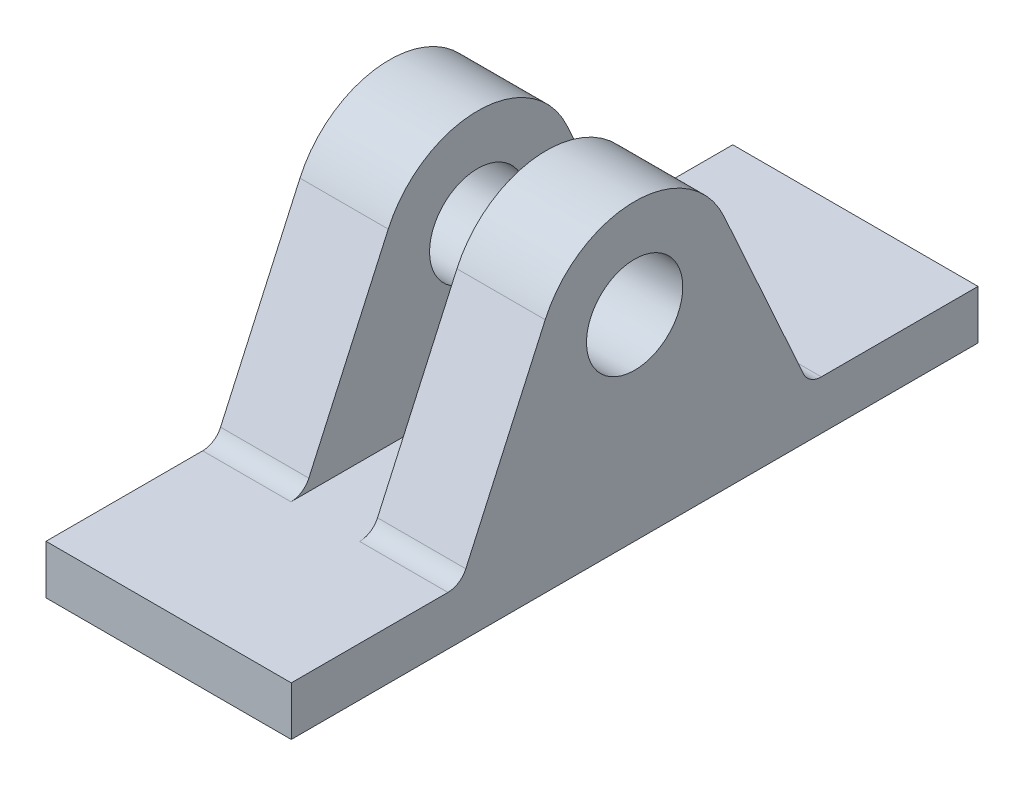
ISO-10303-21;
HEADER;
FILE_DESCRIPTION(('STEP AP214'),'2;1');
FILE_NAME('part.step','',(''),(''),'','','');
FILE_SCHEMA(('AUTOMOTIVE_DESIGN { 1 0 10303 214 1 1 1 1 }'));
ENDSEC;
DATA;
#1=APPLICATION_CONTEXT('core data for automotive mechanical design processes');
#2=APPLICATION_PROTOCOL_DEFINITION('international standard','automotive_design',2000,#1);
#3=PRODUCT_CONTEXT('',#1,'mechanical');
#4=PRODUCT('Part','Part','',(#3));
#5=PRODUCT_RELATED_PRODUCT_CATEGORY('part','',(#4));
#6=PRODUCT_DEFINITION_FORMATION('','',#4);
#7=PRODUCT_DEFINITION_CONTEXT('part definition',#1,'design');
#8=PRODUCT_DEFINITION('design','',#6,#7);
#9=PRODUCT_DEFINITION_SHAPE('','',#8);
#10=(LENGTH_UNIT() NAMED_UNIT(*) SI_UNIT(.MILLI.,.METRE.));
#11=(NAMED_UNIT(*) PLANE_ANGLE_UNIT() SI_UNIT($,.RADIAN.));
#12=(NAMED_UNIT(*) SI_UNIT($,.STERADIAN.) SOLID_ANGLE_UNIT());
#13=UNCERTAINTY_MEASURE_WITH_UNIT(LENGTH_MEASURE(1.E-05),#10,'distance_accuracy_value','');
#14=(GEOMETRIC_REPRESENTATION_CONTEXT(3) GLOBAL_UNCERTAINTY_ASSIGNED_CONTEXT((#13)) GLOBAL_UNIT_ASSIGNED_CONTEXT((#10,
#11,#12)) REPRESENTATION_CONTEXT('',''));
#15=CARTESIAN_POINT('',(0.,0.,0.));
#16=DIRECTION('',(0.,0.,1.));
#17=DIRECTION('',(1.,0.,0.));
#18=AXIS2_PLACEMENT_3D('',#15,#16,#17);
#19=CARTESIAN_POINT('',(-31.75,8.89,-20.2797633552758));
#20=DIRECTION('',(1.,0.,0.));
#21=DIRECTION('',(0.,0.,-1.));
#22=AXIS2_PLACEMENT_3D('',#19,#20,#21);
#23=CYLINDRICAL_SURFACE('',#22,2.54);
#24=CARTESIAN_POINT('',(-20.32,8.89,-20.2797633552758));
#25=DIRECTION('',(-1.,0.,0.));
#26=DIRECTION('',(0.,0.,1.));
#27=AXIS2_PLACEMENT_3D('',#24,#25,#26);
#28=CIRCLE('',#27,2.54);
#29=CARTESIAN_POINT('',(-20.32,7.84524162641579,-22.5949480003583));
#30=VERTEX_POINT('',#29);
#31=CARTESIAN_POINT('',(-20.32,6.35,-20.2797633552758));
#32=VERTEX_POINT('',#31);
#33=EDGE_CURVE('E131',#30,#32,#28,.T.);
#34=ORIENTED_EDGE('',*,*,#33,.F.);
#35=DIRECTION('',(1.,0.,0.));
#36=VECTOR('',#35,1.);
#37=CARTESIAN_POINT('',(-31.75,7.84524162641579,-22.5949480003583));
#38=LINE('',#37,#36);
#39=CARTESIAN_POINT('',(-31.75,7.84524162641579,-22.5949480003583));
#40=VERTEX_POINT('',#39);
#41=EDGE_CURVE('E125',#40,#30,#38,.T.);
#42=ORIENTED_EDGE('',*,*,#41,.F.);
#43=CARTESIAN_POINT('',(-31.75,8.89,-20.2797633552758));
#44=DIRECTION('',(-1.,0.,0.));
#45=DIRECTION('',(0.,0.,-1.));
#46=AXIS2_PLACEMENT_3D('',#43,#44,#45);
#47=CIRCLE('',#46,2.54);
#48=CARTESIAN_POINT('',(-31.75,6.35,-20.2797633552758));
#49=VERTEX_POINT('',#48);
#50=EDGE_CURVE('E128',#40,#49,#47,.T.);
#51=ORIENTED_EDGE('',*,*,#50,.T.);
#52=DIRECTION('',(1.,0.,0.));
#53=VECTOR('',#52,1.);
#54=CARTESIAN_POINT('',(-31.75,6.35,-20.2797633552758));
#55=LINE('',#54,#53);
#56=EDGE_CURVE('E41',#49,#32,#55,.T.);
#57=ORIENTED_EDGE('',*,*,#56,.T.);
#58=EDGE_LOOP('',(#34,#42,#51,#57));
#59=FACE_BOUND('',#58,.T.);
#60=ADVANCED_FACE('F32',(#59),#23,.F.);
#61=CARTESIAN_POINT('',(-31.75,7.84524162641579,-22.5949480003583));
#62=DIRECTION('',(0.,0.411322194324492,0.911490017749007));
#63=DIRECTION('',(0.,-0.911490017749007,0.411322194324492));
#64=AXIS2_PLACEMENT_3D('',#61,#62,#63);
#65=PLANE('',#64);
#66=DIRECTION('',(0.,-0.911490017749007,0.411322194324492));
#67=VECTOR('',#66,1.);
#68=CARTESIAN_POINT('',(-20.32,7.84524162641579,-22.5949480003583));
#69=LINE('',#68,#67);
#70=CARTESIAN_POINT('',(-20.32,30.623791867921,-32.8740767745876));
#71=VERTEX_POINT('',#70);
#72=EDGE_CURVE('E242',#71,#30,#69,.T.);
#73=ORIENTED_EDGE('',*,*,#72,.F.);
#74=DIRECTION('',(1.,0.,0.));
#75=VECTOR('',#74,1.);
#76=CARTESIAN_POINT('',(-31.75,30.623791867921,-32.8740767745876));
#77=LINE('',#76,#75);
#78=CARTESIAN_POINT('',(-31.75,30.623791867921,-32.8740767745876));
#79=VERTEX_POINT('',#78);
#80=EDGE_CURVE('E148',#79,#71,#77,.T.);
#81=ORIENTED_EDGE('',*,*,#80,.F.);
#82=DIRECTION('',(0.,-0.911490017749007,0.411322194324492));
#83=VECTOR('',#82,1.);
#84=CARTESIAN_POINT('',(-31.75,7.84524162641579,-22.5949480003583));
#85=LINE('',#84,#83);
#86=EDGE_CURVE('E142',#79,#40,#85,.T.);
#87=ORIENTED_EDGE('',*,*,#86,.T.);
#88=ORIENTED_EDGE('',*,*,#41,.T.);
#89=EDGE_LOOP('',(#73,#81,#87,#88));
#90=FACE_BOUND('',#89,.T.);
#91=ADVANCED_FACE('F146',(#90),#65,.T.);
#92=CARTESIAN_POINT('',(-31.75,25.4,-44.45));
#93=DIRECTION('',(1.,0.,0.));
#94=DIRECTION('',(0.,0.,-1.));
#95=AXIS2_PLACEMENT_3D('',#92,#93,#94);
#96=CYLINDRICAL_SURFACE('',#95,12.7);
#97=CARTESIAN_POINT('',(-20.32,25.4,-44.45));
#98=DIRECTION('',(-1.,0.,0.));
#99=DIRECTION('',(0.,0.,1.));
#100=AXIS2_PLACEMENT_3D('',#97,#98,#99);
#101=CIRCLE('',#100,12.7);
#102=CARTESIAN_POINT('',(-20.32,30.623791867921,-56.0259232254124));
#103=VERTEX_POINT('',#102);
#104=EDGE_CURVE('E239',#103,#71,#101,.F.);
#105=ORIENTED_EDGE('',*,*,#104,.F.);
#106=DIRECTION('',(1.,0.,0.));
#107=VECTOR('',#106,1.);
#108=CARTESIAN_POINT('',(-31.75,30.623791867921,-56.0259232254124));
#109=LINE('',#108,#107);
#110=CARTESIAN_POINT('',(-31.75,30.623791867921,-56.0259232254124));
#111=VERTEX_POINT('',#110);
#112=EDGE_CURVE('E191',#111,#103,#109,.T.);
#113=ORIENTED_EDGE('',*,*,#112,.F.);
#114=CARTESIAN_POINT('',(-31.75,25.4,-44.45));
#115=DIRECTION('',(1.,0.,0.));
#116=DIRECTION('',(0.,0.,-1.));
#117=AXIS2_PLACEMENT_3D('',#114,#115,#116);
#118=CIRCLE('',#117,12.7);
#119=EDGE_CURVE('E149',#111,#79,#118,.T.);
#120=ORIENTED_EDGE('',*,*,#119,.T.);
#121=ORIENTED_EDGE('',*,*,#80,.T.);
#122=EDGE_LOOP('',(#105,#113,#120,#121));
#123=FACE_BOUND('',#122,.T.);
#124=ADVANCED_FACE('F292',(#123),#96,.T.);
#125=CARTESIAN_POINT('',(-31.75,30.623791867921,-56.0259232254124));
#126=DIRECTION('',(0.,0.411322194324492,-0.911490017749007));
#127=DIRECTION('',(0.,0.911490017749007,0.411322194324492));
#128=AXIS2_PLACEMENT_3D('',#125,#126,#127);
#129=PLANE('',#128);
#130=DIRECTION('',(0.,0.911490017749007,0.411322194324492));
#131=VECTOR('',#130,1.);
#132=CARTESIAN_POINT('',(-20.32,30.623791867921,-56.0259232254124));
#133=LINE('',#132,#131);
#134=CARTESIAN_POINT('',(-20.32,7.84524162641579,-66.3050519996417));
#135=VERTEX_POINT('',#134);
#136=EDGE_CURVE('E236',#135,#103,#133,.T.);
#137=ORIENTED_EDGE('',*,*,#136,.F.);
#138=DIRECTION('',(1.,0.,0.));
#139=VECTOR('',#138,1.);
#140=CARTESIAN_POINT('',(-31.75,7.84524162641579,-66.3050519996417));
#141=LINE('',#140,#139);
#142=CARTESIAN_POINT('',(-31.75,7.84524162641579,-66.3050519996417));
#143=VERTEX_POINT('',#142);
#144=EDGE_CURVE('E195',#143,#135,#141,.T.);
#145=ORIENTED_EDGE('',*,*,#144,.F.);
#146=DIRECTION('',(0.,0.911490017749007,0.411322194324492));
#147=VECTOR('',#146,1.);
#148=CARTESIAN_POINT('',(-31.75,30.623791867921,-56.0259232254124));
#149=LINE('',#148,#147);
#150=EDGE_CURVE('E151',#143,#111,#149,.T.);
#151=ORIENTED_EDGE('',*,*,#150,.T.);
#152=ORIENTED_EDGE('',*,*,#112,.T.);
#153=EDGE_LOOP('',(#137,#145,#151,#152));
#154=FACE_BOUND('',#153,.T.);
#155=ADVANCED_FACE('F266',(#154),#129,.T.);
#156=CARTESIAN_POINT('',(-31.75,8.89,-68.6202366447242));
#157=DIRECTION('',(1.,0.,0.));
#158=DIRECTION('',(0.,0.,-1.));
#159=AXIS2_PLACEMENT_3D('',#156,#157,#158);
#160=CYLINDRICAL_SURFACE('',#159,2.54000000000001);
#161=CARTESIAN_POINT('',(-20.32,8.89,-68.6202366447242));
#162=DIRECTION('',(-1.,0.,0.));
#163=DIRECTION('',(0.,0.,1.));
#164=AXIS2_PLACEMENT_3D('',#161,#162,#163);
#165=CIRCLE('',#164,2.54000000000001);
#166=CARTESIAN_POINT('',(-20.32,6.35,-68.6202366447242));
#167=VERTEX_POINT('',#166);
#168=EDGE_CURVE('E233',#167,#135,#165,.T.);
#169=ORIENTED_EDGE('',*,*,#168,.F.);
#170=DIRECTION('',(1.,0.,0.));
#171=VECTOR('',#170,1.);
#172=CARTESIAN_POINT('',(-31.75,6.35,-68.6202366447242));
#173=LINE('',#172,#171);
#174=CARTESIAN_POINT('',(-31.75,6.35,-68.6202366447242));
#175=VERTEX_POINT('',#174);
#176=EDGE_CURVE('E199',#175,#167,#173,.T.);
#177=ORIENTED_EDGE('',*,*,#176,.F.);
#178=CARTESIAN_POINT('',(-31.75,8.89,-68.6202366447242));
#179=DIRECTION('',(-1.,0.,0.));
#180=DIRECTION('',(0.,0.,-1.));
#181=AXIS2_PLACEMENT_3D('',#178,#179,#180);
#182=CIRCLE('',#181,2.54000000000001);
#183=EDGE_CURVE('E260',#175,#143,#182,.T.);
#184=ORIENTED_EDGE('',*,*,#183,.T.);
#185=ORIENTED_EDGE('',*,*,#144,.T.);
#186=EDGE_LOOP('',(#169,#177,#184,#185));
#187=FACE_BOUND('',#186,.T.);
#188=ADVANCED_FACE('F272',(#187),#160,.F.);
#189=CARTESIAN_POINT('',(-31.75,25.4,-44.45));
#190=DIRECTION('',(1.,0.,0.));
#191=DIRECTION('',(0.,0.,-1.));
#192=AXIS2_PLACEMENT_3D('',#189,#190,#191);
#193=CYLINDRICAL_SURFACE('',#192,6.22935);
#194=CARTESIAN_POINT('',(-20.32,25.4,-44.45));
#195=DIRECTION('',(-1.,0.,0.));
#196=DIRECTION('',(0.,0.,1.));
#197=AXIS2_PLACEMENT_3D('',#194,#195,#196);
#198=CIRCLE('',#197,6.22935);
#199=CARTESIAN_POINT('',(-20.32,25.4,-38.22065));
#200=VERTEX_POINT('',#199);
#201=EDGE_CURVE('E36',#200,#200,#198,.F.);
#202=ORIENTED_EDGE('',*,*,#201,.T.);
#203=EDGE_LOOP('',(#202));
#204=FACE_BOUND('',#203,.T.);
#205=CARTESIAN_POINT('',(-31.75,25.4,-44.45));
#206=DIRECTION('',(1.,0.,0.));
#207=DIRECTION('',(0.,0.,-1.));
#208=AXIS2_PLACEMENT_3D('',#205,#206,#207);
#209=CIRCLE('',#208,6.22935);
#210=CARTESIAN_POINT('',(-31.75,25.4,-50.67935));
#211=VERTEX_POINT('',#210);
#212=EDGE_CURVE('E160',#211,#211,#209,.T.);
#213=ORIENTED_EDGE('',*,*,#212,.F.);
#214=EDGE_LOOP('',(#213));
#215=FACE_BOUND('',#214,.T.);
#216=ADVANCED_FACE('F386',(#204,#215),#193,.F.);
#217=CARTESIAN_POINT('',(-31.75,0.,0.));
#218=DIRECTION('',(0.,0.,1.));
#219=DIRECTION('',(1.,0.,0.));
#220=AXIS2_PLACEMENT_3D('',#217,#218,#219);
#221=PLANE('',#220);
#222=DIRECTION('',(0.,-1.,0.));
#223=VECTOR('',#222,1.);
#224=CARTESIAN_POINT('',(0.,0.,0.));
#225=LINE('',#224,#223);
#226=CARTESIAN_POINT('',(0.,6.35,0.));
#227=VERTEX_POINT('',#226);
#228=CARTESIAN_POINT('',(0.,0.,0.));
#229=VERTEX_POINT('',#228);
#230=EDGE_CURVE('E156',#227,#229,#225,.T.);
#231=ORIENTED_EDGE('',*,*,#230,.F.);
#232=DIRECTION('',(1.,0.,0.));
#233=VECTOR('',#232,1.);
#234=CARTESIAN_POINT('',(-31.75,6.35,0.));
#235=LINE('',#234,#233);
#236=CARTESIAN_POINT('',(-31.75,6.35,0.));
#237=VERTEX_POINT('',#236);
#238=EDGE_CURVE('E11',#237,#227,#235,.T.);
#239=ORIENTED_EDGE('',*,*,#238,.F.);
#240=DIRECTION('',(0.,-1.,0.));
#241=VECTOR('',#240,1.);
#242=CARTESIAN_POINT('',(-31.75,0.,0.));
#243=LINE('',#242,#241);
#244=CARTESIAN_POINT('',(-31.75,0.,0.));
#245=VERTEX_POINT('',#244);
#246=EDGE_CURVE('E186',#237,#245,#243,.T.);
#247=ORIENTED_EDGE('',*,*,#246,.T.);
#248=DIRECTION('',(1.,0.,0.));
#249=VECTOR('',#248,1.);
#250=CARTESIAN_POINT('',(-31.75,0.,0.));
#251=LINE('',#250,#249);
#252=EDGE_CURVE('E99',#245,#229,#251,.T.);
#253=ORIENTED_EDGE('',*,*,#252,.T.);
#254=EDGE_LOOP('',(#231,#239,#247,#253));
#255=FACE_BOUND('',#254,.T.);
#256=ADVANCED_FACE('F34',(#255),#221,.T.);
#257=CARTESIAN_POINT('',(-31.75,6.35,0.));
#258=DIRECTION('',(0.,1.,0.));
#259=DIRECTION('',(0.,0.,1.));
#260=AXIS2_PLACEMENT_3D('',#257,#258,#259);
#261=PLANE('',#260);
#262=CARTESIAN_POINT('',(-11.43,6.35,-20.2797633552758));
#263=VERTEX_POINT('',#262);
#264=CARTESIAN_POINT('',(0.,6.35,-20.2797633552758));
#265=VERTEX_POINT('',#264);
#266=EDGE_CURVE('E135',#263,#265,#55,.T.);
#267=ORIENTED_EDGE('',*,*,#266,.F.);
#268=DIRECTION('',(0.,0.,1.));
#269=VECTOR('',#268,1.);
#270=CARTESIAN_POINT('',(-11.43,6.35,-88.9));
#271=LINE('',#270,#269);
#272=CARTESIAN_POINT('',(-11.43,6.35,-68.6202366447242));
#273=VERTEX_POINT('',#272);
#274=EDGE_CURVE('E49',#273,#263,#271,.T.);
#275=ORIENTED_EDGE('',*,*,#274,.F.);
#276=CARTESIAN_POINT('',(0.,6.35,-68.6202366447242));
#277=VERTEX_POINT('',#276);
#278=EDGE_CURVE('E202',#273,#277,#173,.T.);
#279=ORIENTED_EDGE('',*,*,#278,.T.);
#280=DIRECTION('',(0.,0.,1.));
#281=VECTOR('',#280,1.);
#282=CARTESIAN_POINT('',(0.,6.35,-68.6202366447242));
#283=LINE('',#282,#281);
#284=CARTESIAN_POINT('',(0.,6.35,-88.9));
#285=VERTEX_POINT('',#284);
#286=EDGE_CURVE('E166',#285,#277,#283,.T.);
#287=ORIENTED_EDGE('',*,*,#286,.F.);
#288=DIRECTION('',(1.,0.,0.));
#289=VECTOR('',#288,1.);
#290=CARTESIAN_POINT('',(-31.75,6.35,-88.9));
#291=LINE('',#290,#289);
#292=CARTESIAN_POINT('',(-31.75,6.35,-88.9));
#293=VERTEX_POINT('',#292);
#294=EDGE_CURVE('E203',#293,#285,#291,.T.);
#295=ORIENTED_EDGE('',*,*,#294,.F.);
#296=DIRECTION('',(0.,0.,1.));
#297=VECTOR('',#296,1.);
#298=CARTESIAN_POINT('',(-31.75,6.35,-68.6202366447242));
#299=LINE('',#298,#297);
#300=EDGE_CURVE('E257',#293,#175,#299,.T.);
#301=ORIENTED_EDGE('',*,*,#300,.T.);
#302=ORIENTED_EDGE('',*,*,#176,.T.);
#303=DIRECTION('',(0.,0.,1.));
#304=VECTOR('',#303,1.);
#305=CARTESIAN_POINT('',(-20.32,6.35,-88.9));
#306=LINE('',#305,#304);
#307=EDGE_CURVE('E214',#167,#32,#306,.T.);
#308=ORIENTED_EDGE('',*,*,#307,.T.);
#309=ORIENTED_EDGE('',*,*,#56,.F.);
#310=DIRECTION('',(0.,0.,1.));
#311=VECTOR('',#310,1.);
#312=CARTESIAN_POINT('',(-31.75,6.35,0.));
#313=LINE('',#312,#311);
#314=EDGE_CURVE('E144',#49,#237,#313,.T.);
#315=ORIENTED_EDGE('',*,*,#314,.T.);
#316=ORIENTED_EDGE('',*,*,#238,.T.);
#317=DIRECTION('',(0.,0.,1.));
#318=VECTOR('',#317,1.);
#319=CARTESIAN_POINT('',(0.,6.35,0.));
#320=LINE('',#319,#318);
#321=EDGE_CURVE('E184',#265,#227,#320,.T.);
#322=ORIENTED_EDGE('',*,*,#321,.F.);
#323=EDGE_LOOP('',(#267,#275,#279,#287,#295,#301,#302,#308,#309,#315,#316,#322));
#324=FACE_BOUND('',#323,.T.);
#325=ADVANCED_FACE('F275',(#324),#261,.T.);
#326=CARTESIAN_POINT('',(-11.43,8.89,-20.2797633552758));
#327=DIRECTION('',(1.,0.,0.));
#328=DIRECTION('',(0.,1.,0.));
#329=AXIS2_PLACEMENT_3D('',#326,#327,#328);
#330=CIRCLE('',#329,2.54);
#331=CARTESIAN_POINT('',(-11.43,7.84524162641579,-22.5949480003583));
#332=VERTEX_POINT('',#331);
#333=EDGE_CURVE('E231',#263,#332,#330,.T.);
#334=ORIENTED_EDGE('',*,*,#333,.F.);
#335=ORIENTED_EDGE('',*,*,#266,.T.);
#336=CARTESIAN_POINT('',(0.,8.89,-20.2797633552758));
#337=DIRECTION('',(-1.,0.,0.));
#338=DIRECTION('',(0.,0.,-1.));
#339=AXIS2_PLACEMENT_3D('',#336,#337,#338);
#340=CIRCLE('',#339,2.54);
#341=CARTESIAN_POINT('',(0.,7.84524162641579,-22.5949480003583));
#342=VERTEX_POINT('',#341);
#343=EDGE_CURVE('E181',#342,#265,#340,.T.);
#344=ORIENTED_EDGE('',*,*,#343,.F.);
#345=EDGE_CURVE('E136',#332,#342,#38,.T.);
#346=ORIENTED_EDGE('',*,*,#345,.F.);
#347=EDGE_LOOP('',(#334,#335,#344,#346));
#348=FACE_BOUND('',#347,.T.);
#349=ADVANCED_FACE('F308',(#348),#23,.F.);
#350=DIRECTION('',(0.,0.911490017749007,-0.411322194324492));
#351=VECTOR('',#350,1.);
#352=CARTESIAN_POINT('',(-11.43,7.8452416264158,-22.5949480003583));
#353=LINE('',#352,#351);
#354=CARTESIAN_POINT('',(-11.43,30.623791867921,-32.8740767745876));
#355=VERTEX_POINT('',#354);
#356=EDGE_CURVE('E228',#332,#355,#353,.T.);
#357=ORIENTED_EDGE('',*,*,#356,.F.);
#358=ORIENTED_EDGE('',*,*,#345,.T.);
#359=DIRECTION('',(0.,-0.911490017749007,0.411322194324492));
#360=VECTOR('',#359,1.);
#361=CARTESIAN_POINT('',(0.,7.84524162641579,-22.5949480003583));
#362=LINE('',#361,#360);
#363=CARTESIAN_POINT('',(0.,30.623791867921,-32.8740767745876));
#364=VERTEX_POINT('',#363);
#365=EDGE_CURVE('E178',#364,#342,#362,.T.);
#366=ORIENTED_EDGE('',*,*,#365,.F.);
#367=EDGE_CURVE('E190',#355,#364,#77,.T.);
#368=ORIENTED_EDGE('',*,*,#367,.F.);
#369=EDGE_LOOP('',(#357,#358,#366,#368));
#370=FACE_BOUND('',#369,.T.);
#371=ADVANCED_FACE('F303',(#370),#65,.T.);
#372=CARTESIAN_POINT('',(-11.43,30.623791867921,-56.0259232254124));
#373=VERTEX_POINT('',#372);
#374=CARTESIAN_POINT('',(0.,30.623791867921,-56.0259232254124));
#375=VERTEX_POINT('',#374);
#376=EDGE_CURVE('E194',#373,#375,#109,.T.);
#377=ORIENTED_EDGE('',*,*,#376,.F.);
#378=CARTESIAN_POINT('',(-11.43,25.4,-44.45));
#379=DIRECTION('',(1.,0.,0.));
#380=DIRECTION('',(0.,1.,0.));
#381=AXIS2_PLACEMENT_3D('',#378,#379,#380);
#382=CIRCLE('',#381,12.7);
#383=EDGE_CURVE('E225',#355,#373,#382,.F.);
#384=ORIENTED_EDGE('',*,*,#383,.F.);
#385=ORIENTED_EDGE('',*,*,#367,.T.);
#386=CARTESIAN_POINT('',(0.,25.4,-44.45));
#387=DIRECTION('',(1.,0.,0.));
#388=DIRECTION('',(0.,0.,-1.));
#389=AXIS2_PLACEMENT_3D('',#386,#387,#388);
#390=CIRCLE('',#389,12.7);
#391=EDGE_CURVE('E175',#375,#364,#390,.T.);
#392=ORIENTED_EDGE('',*,*,#391,.F.);
#393=EDGE_LOOP('',(#377,#384,#385,#392));
#394=FACE_BOUND('',#393,.T.);
#395=ADVANCED_FACE('F295',(#394),#96,.T.);
#396=DIRECTION('',(0.,-0.911490017749007,-0.411322194324492));
#397=VECTOR('',#396,1.);
#398=CARTESIAN_POINT('',(-11.43,30.6237918679211,-56.0259232254124));
#399=LINE('',#398,#397);
#400=CARTESIAN_POINT('',(-11.43,7.84524162641579,-66.3050519996417));
#401=VERTEX_POINT('',#400);
#402=EDGE_CURVE('E212',#373,#401,#399,.T.);
#403=ORIENTED_EDGE('',*,*,#402,.F.);
#404=ORIENTED_EDGE('',*,*,#376,.T.);
#405=DIRECTION('',(0.,0.911490017749007,0.411322194324492));
#406=VECTOR('',#405,1.);
#407=CARTESIAN_POINT('',(0.,30.623791867921,-56.0259232254124));
#408=LINE('',#407,#406);
#409=CARTESIAN_POINT('',(0.,7.84524162641579,-66.3050519996417));
#410=VERTEX_POINT('',#409);
#411=EDGE_CURVE('E172',#410,#375,#408,.T.);
#412=ORIENTED_EDGE('',*,*,#411,.F.);
#413=EDGE_CURVE('E198',#401,#410,#141,.T.);
#414=ORIENTED_EDGE('',*,*,#413,.F.);
#415=EDGE_LOOP('',(#403,#404,#412,#414));
#416=FACE_BOUND('',#415,.T.);
#417=ADVANCED_FACE('F301',(#416),#129,.T.);
#418=CARTESIAN_POINT('',(-11.43,8.89,-68.6202366447242));
#419=DIRECTION('',(1.,0.,0.));
#420=DIRECTION('',(0.,1.,0.));
#421=AXIS2_PLACEMENT_3D('',#418,#419,#420);
#422=CIRCLE('',#421,2.54000000000001);
#423=EDGE_CURVE('E209',#401,#273,#422,.T.);
#424=ORIENTED_EDGE('',*,*,#423,.F.);
#425=ORIENTED_EDGE('',*,*,#413,.T.);
#426=CARTESIAN_POINT('',(0.,8.89,-68.6202366447242));
#427=DIRECTION('',(-1.,0.,0.));
#428=DIRECTION('',(0.,0.,-1.));
#429=AXIS2_PLACEMENT_3D('',#426,#427,#428);
#430=CIRCLE('',#429,2.54000000000001);
#431=EDGE_CURVE('E169',#277,#410,#430,.T.);
#432=ORIENTED_EDGE('',*,*,#431,.F.);
#433=ORIENTED_EDGE('',*,*,#278,.F.);
#434=EDGE_LOOP('',(#424,#425,#432,#433));
#435=FACE_BOUND('',#434,.T.);
#436=ADVANCED_FACE('F343',(#435),#160,.F.);
#437=CARTESIAN_POINT('',(-31.75,0.,-88.9));
#438=DIRECTION('',(0.,0.,-1.));
#439=DIRECTION('',(-1.,0.,0.));
#440=AXIS2_PLACEMENT_3D('',#437,#438,#439);
#441=PLANE('',#440);
#442=DIRECTION('',(0.,1.,0.));
#443=VECTOR('',#442,1.);
#444=CARTESIAN_POINT('',(0.,0.,-88.9));
#445=LINE('',#444,#443);
#446=CARTESIAN_POINT('',(0.,0.,-88.9));
#447=VERTEX_POINT('',#446);
#448=EDGE_CURVE('E163',#447,#285,#445,.T.);
#449=ORIENTED_EDGE('',*,*,#448,.F.);
#450=DIRECTION('',(1.,0.,0.));
#451=VECTOR('',#450,1.);
#452=CARTESIAN_POINT('',(-31.75,0.,-88.9));
#453=LINE('',#452,#451);
#454=CARTESIAN_POINT('',(-31.75,0.,-88.9));
#455=VERTEX_POINT('',#454);
#456=EDGE_CURVE('E205',#455,#447,#453,.T.);
#457=ORIENTED_EDGE('',*,*,#456,.F.);
#458=DIRECTION('',(0.,1.,0.));
#459=VECTOR('',#458,1.);
#460=CARTESIAN_POINT('',(-31.75,0.,-88.9));
#461=LINE('',#460,#459);
#462=EDGE_CURVE('E254',#455,#293,#461,.T.);
#463=ORIENTED_EDGE('',*,*,#462,.T.);
#464=ORIENTED_EDGE('',*,*,#294,.T.);
#465=EDGE_LOOP('',(#449,#457,#463,#464));
#466=FACE_BOUND('',#465,.T.);
#467=ADVANCED_FACE('F348',(#466),#441,.T.);
#468=CARTESIAN_POINT('',(-31.75,0.,0.));
#469=DIRECTION('',(0.,-1.,0.));
#470=DIRECTION('',(0.,0.,-1.));
#471=AXIS2_PLACEMENT_3D('',#468,#469,#470);
#472=PLANE('',#471);
#473=DIRECTION('',(0.,0.,-1.));
#474=VECTOR('',#473,1.);
#475=CARTESIAN_POINT('',(0.,0.,0.));
#476=LINE('',#475,#474);
#477=EDGE_CURVE('E159',#229,#447,#476,.T.);
#478=ORIENTED_EDGE('',*,*,#477,.F.);
#479=ORIENTED_EDGE('',*,*,#252,.F.);
#480=DIRECTION('',(0.,0.,-1.));
#481=VECTOR('',#480,1.);
#482=CARTESIAN_POINT('',(-31.75,0.,0.));
#483=LINE('',#482,#481);
#484=EDGE_CURVE('E252',#245,#455,#483,.T.);
#485=ORIENTED_EDGE('',*,*,#484,.T.);
#486=ORIENTED_EDGE('',*,*,#456,.T.);
#487=EDGE_LOOP('',(#478,#479,#485,#486));
#488=FACE_BOUND('',#487,.T.);
#489=ADVANCED_FACE('F350',(#488),#472,.T.);
#490=CARTESIAN_POINT('',(-31.75,8.89,-20.2797633552758));
#491=DIRECTION('',(1.,0.,0.));
#492=DIRECTION('',(0.,0.,-1.));
#493=AXIS2_PLACEMENT_3D('',#490,#491,#492);
#494=PLANE('',#493);
#495=ORIENTED_EDGE('',*,*,#212,.T.);
#496=EDGE_LOOP('',(#495));
#497=FACE_BOUND('',#496,.T.);
#498=ORIENTED_EDGE('',*,*,#246,.F.);
#499=ORIENTED_EDGE('',*,*,#314,.F.);
#500=ORIENTED_EDGE('',*,*,#50,.F.);
#501=ORIENTED_EDGE('',*,*,#86,.F.);
#502=ORIENTED_EDGE('',*,*,#119,.F.);
#503=ORIENTED_EDGE('',*,*,#150,.F.);
#504=ORIENTED_EDGE('',*,*,#183,.F.);
#505=ORIENTED_EDGE('',*,*,#300,.F.);
#506=ORIENTED_EDGE('',*,*,#462,.F.);
#507=ORIENTED_EDGE('',*,*,#484,.F.);
#508=EDGE_LOOP('',(#498,#499,#500,#501,#502,#503,#504,#505,#506,#507));
#509=FACE_BOUND('',#508,.T.);
#510=ADVANCED_FACE('F140',(#497,#509),#494,.F.);
#511=CARTESIAN_POINT('',(0.,8.89,-20.2797633552758));
#512=DIRECTION('',(1.,0.,0.));
#513=DIRECTION('',(0.,0.,-1.));
#514=AXIS2_PLACEMENT_3D('',#511,#512,#513);
#515=PLANE('',#514);
#516=CARTESIAN_POINT('',(0.,25.4,-44.45));
#517=DIRECTION('',(1.,0.,0.));
#518=DIRECTION('',(0.,0.,-1.));
#519=AXIS2_PLACEMENT_3D('',#516,#517,#518);
#520=CIRCLE('',#519,6.22935);
#521=CARTESIAN_POINT('',(0.,25.4,-50.67935));
#522=VERTEX_POINT('',#521);
#523=EDGE_CURVE('E246',#522,#522,#520,.T.);
#524=ORIENTED_EDGE('',*,*,#523,.F.);
#525=EDGE_LOOP('',(#524));
#526=FACE_BOUND('',#525,.T.);
#527=ORIENTED_EDGE('',*,*,#230,.T.);
#528=ORIENTED_EDGE('',*,*,#477,.T.);
#529=ORIENTED_EDGE('',*,*,#448,.T.);
#530=ORIENTED_EDGE('',*,*,#286,.T.);
#531=ORIENTED_EDGE('',*,*,#431,.T.);
#532=ORIENTED_EDGE('',*,*,#411,.T.);
#533=ORIENTED_EDGE('',*,*,#391,.T.);
#534=ORIENTED_EDGE('',*,*,#365,.T.);
#535=ORIENTED_EDGE('',*,*,#343,.T.);
#536=ORIENTED_EDGE('',*,*,#321,.T.);
#537=EDGE_LOOP('',(#527,#528,#529,#530,#531,#532,#533,#534,#535,#536));
#538=FACE_BOUND('',#537,.T.);
#539=ADVANCED_FACE('F325',(#526,#538),#515,.T.);
#540=CARTESIAN_POINT('',(-11.43,25.4,-44.45));
#541=DIRECTION('',(1.,0.,0.));
#542=DIRECTION('',(0.,1.,0.));
#543=AXIS2_PLACEMENT_3D('',#540,#541,#542);
#544=CIRCLE('',#543,6.22935);
#545=CARTESIAN_POINT('',(-11.43,31.62935,-44.45));
#546=VERTEX_POINT('',#545);
#547=EDGE_CURVE('E207',#546,#546,#544,.F.);
#548=ORIENTED_EDGE('',*,*,#547,.T.);
#549=EDGE_LOOP('',(#548));
#550=FACE_BOUND('',#549,.T.);
#551=ORIENTED_EDGE('',*,*,#523,.T.);
#552=EDGE_LOOP('',(#551));
#553=FACE_BOUND('',#552,.T.);
#554=ADVANCED_FACE('F380',(#550,#553),#193,.F.);
#555=CARTESIAN_POINT('',(-20.32,6.35,-88.9));
#556=DIRECTION('',(-1.,0.,0.));
#557=DIRECTION('',(0.,0.,1.));
#558=AXIS2_PLACEMENT_3D('',#555,#556,#557);
#559=PLANE('',#558);
#560=ORIENTED_EDGE('',*,*,#33,.T.);
#561=ORIENTED_EDGE('',*,*,#307,.F.);
#562=ORIENTED_EDGE('',*,*,#168,.T.);
#563=ORIENTED_EDGE('',*,*,#136,.T.);
#564=ORIENTED_EDGE('',*,*,#104,.T.);
#565=ORIENTED_EDGE('',*,*,#72,.T.);
#566=EDGE_LOOP('',(#560,#561,#562,#563,#564,#565));
#567=FACE_BOUND('',#566,.T.);
#568=ORIENTED_EDGE('',*,*,#201,.F.);
#569=EDGE_LOOP('',(#568));
#570=FACE_BOUND('',#569,.T.);
#571=ADVANCED_FACE('F289',(#567,#570),#559,.F.);
#572=CARTESIAN_POINT('',(-11.43,6.35,-88.9));
#573=DIRECTION('',(1.,0.,0.));
#574=DIRECTION('',(0.,1.,0.));
#575=AXIS2_PLACEMENT_3D('',#572,#573,#574);
#576=PLANE('',#575);
#577=ORIENTED_EDGE('',*,*,#333,.T.);
#578=ORIENTED_EDGE('',*,*,#356,.T.);
#579=ORIENTED_EDGE('',*,*,#383,.T.);
#580=ORIENTED_EDGE('',*,*,#402,.T.);
#581=ORIENTED_EDGE('',*,*,#423,.T.);
#582=ORIENTED_EDGE('',*,*,#274,.T.);
#583=EDGE_LOOP('',(#577,#578,#579,#580,#581,#582));
#584=FACE_BOUND('',#583,.T.);
#585=ORIENTED_EDGE('',*,*,#547,.F.);
#586=EDGE_LOOP('',(#585));
#587=FACE_BOUND('',#586,.T.);
#588=ADVANCED_FACE('F330',(#584,#587),#576,.F.);
#589=CLOSED_SHELL('',(#60,#91,#124,#155,#188,#216,#256,#325,#349,#371,#395,#417,#436,#467,#489,
#510,#539,#554,#571,#588));
#590=MANIFOLD_SOLID_BREP('B2',#589);
#591=ADVANCED_BREP_SHAPE_REPRESENTATION('',(#18,#590),#14);
#592=SHAPE_DEFINITION_REPRESENTATION(#9,#591);
ENDSEC;
END-ISO-10303-21;
